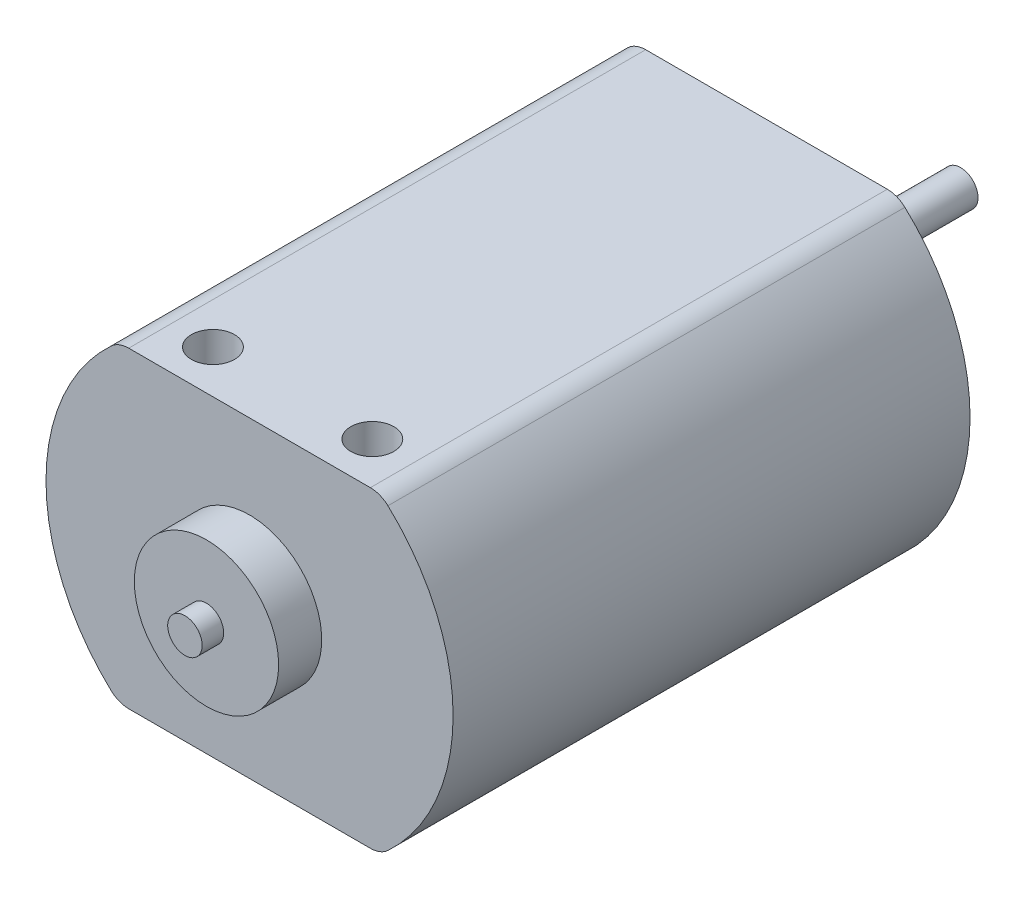
ISO-10303-21;
HEADER;
FILE_DESCRIPTION(('STEP AP214'),'2;1');
FILE_NAME('part.step','',(''),(''),'','','');
FILE_SCHEMA(('AUTOMOTIVE_DESIGN { 1 0 10303 214 1 1 1 1 }'));
ENDSEC;
DATA;
#1=APPLICATION_CONTEXT('core data for automotive mechanical design processes');
#2=APPLICATION_PROTOCOL_DEFINITION('international standard','automotive_design',2000,#1);
#3=PRODUCT_CONTEXT('',#1,'mechanical');
#4=PRODUCT('Part','Part','',(#3));
#5=PRODUCT_RELATED_PRODUCT_CATEGORY('part','',(#4));
#6=PRODUCT_DEFINITION_FORMATION('','',#4);
#7=PRODUCT_DEFINITION_CONTEXT('part definition',#1,'design');
#8=PRODUCT_DEFINITION('design','',#6,#7);
#9=PRODUCT_DEFINITION_SHAPE('','',#8);
#10=(LENGTH_UNIT() NAMED_UNIT(*) SI_UNIT(.MILLI.,.METRE.));
#11=(NAMED_UNIT(*) PLANE_ANGLE_UNIT() SI_UNIT($,.RADIAN.));
#12=(NAMED_UNIT(*) SI_UNIT($,.STERADIAN.) SOLID_ANGLE_UNIT());
#13=UNCERTAINTY_MEASURE_WITH_UNIT(LENGTH_MEASURE(1.E-05),#10,'distance_accuracy_value','');
#14=(GEOMETRIC_REPRESENTATION_CONTEXT(3) GLOBAL_UNCERTAINTY_ASSIGNED_CONTEXT((#13)) GLOBAL_UNIT_ASSIGNED_CONTEXT((#10,
#11,#12)) REPRESENTATION_CONTEXT('',''));
#15=CARTESIAN_POINT('',(0.,0.,0.));
#16=DIRECTION('',(0.,0.,1.));
#17=DIRECTION('',(1.,0.,0.));
#18=AXIS2_PLACEMENT_3D('',#15,#16,#17);
#19=CARTESIAN_POINT('',(0.,0.,-1.5875));
#20=DIRECTION('',(0.,0.,-1.));
#21=DIRECTION('',(-1.,0.,0.));
#22=AXIS2_PLACEMENT_3D('',#19,#20,#21);
#23=PLANE('',#22);
#24=CARTESIAN_POINT('',(0.,0.,-1.5875));
#25=DIRECTION('',(0.,0.,-1.));
#26=DIRECTION('',(-1.,0.,0.));
#27=AXIS2_PLACEMENT_3D('',#24,#25,#26);
#28=CIRCLE('',#27,3.048);
#29=CARTESIAN_POINT('',(-3.048,0.,-1.5875));
#30=VERTEX_POINT('',#29);
#31=EDGE_CURVE('E193',#30,#30,#28,.T.);
#32=ORIENTED_EDGE('',*,*,#31,.T.);
#33=EDGE_LOOP('',(#32));
#34=FACE_BOUND('',#33,.T.);
#35=CARTESIAN_POINT('',(0.,0.,-1.5875));
#36=DIRECTION('',(0.,0.,-1.));
#37=DIRECTION('',(-1.,0.,0.));
#38=AXIS2_PLACEMENT_3D('',#35,#36,#37);
#39=CIRCLE('',#38,1.0287);
#40=CARTESIAN_POINT('',(-1.0287,0.,-1.5875));
#41=VERTEX_POINT('',#40);
#42=EDGE_CURVE('E202',#41,#41,#39,.T.);
#43=ORIENTED_EDGE('',*,*,#42,.F.);
#44=EDGE_LOOP('',(#43));
#45=FACE_BOUND('',#44,.T.);
#46=ADVANCED_FACE('F35',(#34,#45),#23,.T.);
#47=CARTESIAN_POINT('',(-7.12333026048912,-7.6835,0.));
#48=DIRECTION('',(0.,0.,-1.));
#49=DIRECTION('',(-1.,0.,0.));
#50=AXIS2_PLACEMENT_3D('',#47,#48,#49);
#51=PLANE('',#50);
#52=CARTESIAN_POINT('',(-7.12333026048912,-7.6835,0.));
#53=DIRECTION('',(0.,0.,1.));
#54=DIRECTION('',(-1.,0.,0.));
#55=AXIS2_PLACEMENT_3D('',#52,#53,#54);
#56=CIRCLE('',#55,1.524);
#57=CARTESIAN_POINT('',(-8.15945102565117,-8.8011,0.));
#58=VERTEX_POINT('',#57);
#59=CARTESIAN_POINT('',(-7.12333026048912,-9.2075,0.));
#60=VERTEX_POINT('',#59);
#61=EDGE_CURVE('E134',#58,#60,#56,.T.);
#62=ORIENTED_EDGE('',*,*,#61,.F.);
#63=CARTESIAN_POINT('',(0.,0.,0.));
#64=DIRECTION('',(0.,0.,1.));
#65=DIRECTION('',(1.,0.,0.));
#66=AXIS2_PLACEMENT_3D('',#63,#64,#65);
#67=CIRCLE('',#66,12.0015);
#68=CARTESIAN_POINT('',(-8.15945102565117,8.8011,0.));
#69=VERTEX_POINT('',#68);
#70=EDGE_CURVE('E87',#69,#58,#67,.T.);
#71=ORIENTED_EDGE('',*,*,#70,.F.);
#72=CARTESIAN_POINT('',(-7.12333026048912,7.6835,0.));
#73=DIRECTION('',(0.,0.,1.));
#74=DIRECTION('',(1.,0.,0.));
#75=AXIS2_PLACEMENT_3D('',#72,#73,#74);
#76=CIRCLE('',#75,1.524);
#77=CARTESIAN_POINT('',(-7.12333026048912,9.2075,0.));
#78=VERTEX_POINT('',#77);
#79=EDGE_CURVE('E81',#78,#69,#76,.T.);
#80=ORIENTED_EDGE('',*,*,#79,.F.);
#81=DIRECTION('',(-1.,0.,0.));
#82=VECTOR('',#81,1.);
#83=CARTESIAN_POINT('',(-7.12333026048912,9.2075,0.));
#84=LINE('',#83,#82);
#85=CARTESIAN_POINT('',(7.12333026048912,9.2075,0.));
#86=VERTEX_POINT('',#85);
#87=EDGE_CURVE('E124',#86,#78,#84,.T.);
#88=ORIENTED_EDGE('',*,*,#87,.F.);
#89=CARTESIAN_POINT('',(7.12333026048912,7.6835,0.));
#90=DIRECTION('',(0.,0.,1.));
#91=DIRECTION('',(-1.,0.,0.));
#92=AXIS2_PLACEMENT_3D('',#89,#90,#91);
#93=CIRCLE('',#92,1.524);
#94=CARTESIAN_POINT('',(8.15945102565117,8.8011,0.));
#95=VERTEX_POINT('',#94);
#96=EDGE_CURVE('E144',#95,#86,#93,.T.);
#97=ORIENTED_EDGE('',*,*,#96,.F.);
#98=CARTESIAN_POINT('',(0.,0.,0.));
#99=DIRECTION('',(0.,0.,1.));
#100=DIRECTION('',(1.,0.,0.));
#101=AXIS2_PLACEMENT_3D('',#98,#99,#100);
#102=CIRCLE('',#101,12.0015);
#103=CARTESIAN_POINT('',(8.15945102565117,-8.8011,0.));
#104=VERTEX_POINT('',#103);
#105=EDGE_CURVE('E142',#104,#95,#102,.T.);
#106=ORIENTED_EDGE('',*,*,#105,.F.);
#107=CARTESIAN_POINT('',(7.12333026048912,-7.6835,0.));
#108=DIRECTION('',(0.,0.,1.));
#109=DIRECTION('',(1.,0.,0.));
#110=AXIS2_PLACEMENT_3D('',#107,#108,#109);
#111=CIRCLE('',#110,1.524);
#112=CARTESIAN_POINT('',(7.12333026048912,-9.2075,0.));
#113=VERTEX_POINT('',#112);
#114=EDGE_CURVE('E140',#113,#104,#111,.T.);
#115=ORIENTED_EDGE('',*,*,#114,.F.);
#116=DIRECTION('',(1.,0.,0.));
#117=VECTOR('',#116,1.);
#118=CARTESIAN_POINT('',(-7.12333026048912,-9.2075,0.));
#119=LINE('',#118,#117);
#120=EDGE_CURVE('E137',#60,#113,#119,.T.);
#121=ORIENTED_EDGE('',*,*,#120,.F.);
#122=EDGE_LOOP('',(#62,#71,#80,#88,#97,#106,#115,#121));
#123=FACE_BOUND('',#122,.T.);
#124=CARTESIAN_POINT('',(0.,0.,0.));
#125=DIRECTION('',(0.,0.,-1.));
#126=DIRECTION('',(-1.,0.,0.));
#127=AXIS2_PLACEMENT_3D('',#124,#125,#126);
#128=CIRCLE('',#127,3.048);
#129=CARTESIAN_POINT('',(-3.048,0.,0.));
#130=VERTEX_POINT('',#129);
#131=EDGE_CURVE('E196',#130,#130,#128,.T.);
#132=ORIENTED_EDGE('',*,*,#131,.F.);
#133=EDGE_LOOP('',(#132));
#134=FACE_BOUND('',#133,.T.);
#135=ADVANCED_FACE('F167',(#123,#134),#51,.T.);
#136=CARTESIAN_POINT('',(0.,0.,33.02));
#137=DIRECTION('',(0.,0.,1.));
#138=DIRECTION('',(1.,0.,0.));
#139=AXIS2_PLACEMENT_3D('',#136,#137,#138);
#140=PLANE('',#139);
#141=CARTESIAN_POINT('',(0.,0.,33.02));
#142=DIRECTION('',(0.,0.,1.));
#143=DIRECTION('',(1.,0.,0.));
#144=AXIS2_PLACEMENT_3D('',#141,#142,#143);
#145=CIRCLE('',#144,4.2545);
#146=CARTESIAN_POINT('',(4.2545,0.,33.02));
#147=VERTEX_POINT('',#146);
#148=EDGE_CURVE('E138',#147,#147,#145,.T.);
#149=ORIENTED_EDGE('',*,*,#148,.T.);
#150=EDGE_LOOP('',(#149));
#151=FACE_BOUND('',#150,.T.);
#152=CARTESIAN_POINT('',(0.,0.,33.02));
#153=DIRECTION('',(0.,0.,1.));
#154=DIRECTION('',(1.,0.,0.));
#155=AXIS2_PLACEMENT_3D('',#152,#153,#154);
#156=CIRCLE('',#155,1.016);
#157=CARTESIAN_POINT('',(1.016,0.,33.02));
#158=VERTEX_POINT('',#157);
#159=EDGE_CURVE('E190',#158,#158,#156,.T.);
#160=ORIENTED_EDGE('',*,*,#159,.F.);
#161=EDGE_LOOP('',(#160));
#162=FACE_BOUND('',#161,.T.);
#163=ADVANCED_FACE('F256',(#151,#162),#140,.T.);
#164=CARTESIAN_POINT('',(-7.12333026048912,-7.6835,30.48));
#165=DIRECTION('',(0.,0.,-1.));
#166=DIRECTION('',(-1.,0.,0.));
#167=AXIS2_PLACEMENT_3D('',#164,#165,#166);
#168=PLANE('',#167);
#169=CARTESIAN_POINT('',(-7.12333026048912,-7.6835,30.48));
#170=DIRECTION('',(0.,0.,1.));
#171=DIRECTION('',(-1.,0.,0.));
#172=AXIS2_PLACEMENT_3D('',#169,#170,#171);
#173=CIRCLE('',#172,1.524);
#174=CARTESIAN_POINT('',(-8.15945102565117,-8.8011,30.48));
#175=VERTEX_POINT('',#174);
#176=CARTESIAN_POINT('',(-7.12333026048912,-9.2075,30.48));
#177=VERTEX_POINT('',#176);
#178=EDGE_CURVE('E149',#175,#177,#173,.T.);
#179=ORIENTED_EDGE('',*,*,#178,.T.);
#180=DIRECTION('',(1.,0.,0.));
#181=VECTOR('',#180,1.);
#182=CARTESIAN_POINT('',(-7.12333026048912,-9.2075,30.48));
#183=LINE('',#182,#181);
#184=CARTESIAN_POINT('',(7.12333026048912,-9.2075,30.48));
#185=VERTEX_POINT('',#184);
#186=EDGE_CURVE('E96',#177,#185,#183,.T.);
#187=ORIENTED_EDGE('',*,*,#186,.T.);
#188=CARTESIAN_POINT('',(7.12333026048912,-7.6835,30.48));
#189=DIRECTION('',(0.,0.,1.));
#190=DIRECTION('',(1.,0.,0.));
#191=AXIS2_PLACEMENT_3D('',#188,#189,#190);
#192=CIRCLE('',#191,1.524);
#193=CARTESIAN_POINT('',(8.15945102565117,-8.8011,30.48));
#194=VERTEX_POINT('',#193);
#195=EDGE_CURVE('E181',#185,#194,#192,.T.);
#196=ORIENTED_EDGE('',*,*,#195,.T.);
#197=CARTESIAN_POINT('',(0.,0.,30.48));
#198=DIRECTION('',(0.,0.,1.));
#199=DIRECTION('',(1.,0.,0.));
#200=AXIS2_PLACEMENT_3D('',#197,#198,#199);
#201=CIRCLE('',#200,12.0015);
#202=CARTESIAN_POINT('',(8.15945102565117,8.8011,30.48));
#203=VERTEX_POINT('',#202);
#204=EDGE_CURVE('E180',#194,#203,#201,.T.);
#205=ORIENTED_EDGE('',*,*,#204,.T.);
#206=CARTESIAN_POINT('',(7.12333026048912,7.6835,30.48));
#207=DIRECTION('',(0.,0.,1.));
#208=DIRECTION('',(-1.,0.,0.));
#209=AXIS2_PLACEMENT_3D('',#206,#207,#208);
#210=CIRCLE('',#209,1.524);
#211=CARTESIAN_POINT('',(7.12333026048912,9.2075,30.48));
#212=VERTEX_POINT('',#211);
#213=EDGE_CURVE('E116',#203,#212,#210,.T.);
#214=ORIENTED_EDGE('',*,*,#213,.T.);
#215=DIRECTION('',(-1.,0.,0.));
#216=VECTOR('',#215,1.);
#217=CARTESIAN_POINT('',(-7.12333026048912,9.2075,30.48));
#218=LINE('',#217,#216);
#219=CARTESIAN_POINT('',(-7.12333026048912,9.2075,30.48));
#220=VERTEX_POINT('',#219);
#221=EDGE_CURVE('E109',#212,#220,#218,.T.);
#222=ORIENTED_EDGE('',*,*,#221,.T.);
#223=CARTESIAN_POINT('',(-7.12333026048912,7.6835,30.48));
#224=DIRECTION('',(0.,0.,1.));
#225=DIRECTION('',(1.,0.,0.));
#226=AXIS2_PLACEMENT_3D('',#223,#224,#225);
#227=CIRCLE('',#226,1.524);
#228=CARTESIAN_POINT('',(-8.15945102565117,8.8011,30.48));
#229=VERTEX_POINT('',#228);
#230=EDGE_CURVE('E114',#220,#229,#227,.T.);
#231=ORIENTED_EDGE('',*,*,#230,.T.);
#232=CARTESIAN_POINT('',(0.,0.,30.48));
#233=DIRECTION('',(0.,0.,1.));
#234=DIRECTION('',(1.,0.,0.));
#235=AXIS2_PLACEMENT_3D('',#232,#233,#234);
#236=CIRCLE('',#235,12.0015);
#237=EDGE_CURVE('E52',#229,#175,#236,.T.);
#238=ORIENTED_EDGE('',*,*,#237,.T.);
#239=EDGE_LOOP('',(#179,#187,#196,#205,#214,#222,#231,#238));
#240=FACE_BOUND('',#239,.T.);
#241=CARTESIAN_POINT('',(0.,0.,30.48));
#242=DIRECTION('',(0.,0.,-1.));
#243=DIRECTION('',(-1.,0.,0.));
#244=AXIS2_PLACEMENT_3D('',#241,#242,#243);
#245=CIRCLE('',#244,4.2545);
#246=CARTESIAN_POINT('',(-4.2545,0.,30.48));
#247=VERTEX_POINT('',#246);
#248=EDGE_CURVE('E11',#247,#247,#245,.F.);
#249=ORIENTED_EDGE('',*,*,#248,.F.);
#250=EDGE_LOOP('',(#249));
#251=FACE_BOUND('',#250,.T.);
#252=ADVANCED_FACE('F111',(#240,#251),#168,.F.);
#253=CARTESIAN_POINT('',(-7.12333026048912,-7.6835,30.48));
#254=DIRECTION('',(0.,0.,-1.));
#255=DIRECTION('',(-1.,0.,0.));
#256=AXIS2_PLACEMENT_3D('',#253,#254,#255);
#257=CYLINDRICAL_SURFACE('',#256,1.524);
#258=ORIENTED_EDGE('',*,*,#61,.T.);
#259=DIRECTION('',(0.,0.,-1.));
#260=VECTOR('',#259,1.);
#261=CARTESIAN_POINT('',(-7.12333026048912,-9.2075,30.48));
#262=LINE('',#261,#260);
#263=EDGE_CURVE('E44',#177,#60,#262,.T.);
#264=ORIENTED_EDGE('',*,*,#263,.F.);
#265=ORIENTED_EDGE('',*,*,#178,.F.);
#266=DIRECTION('',(0.,0.,-1.));
#267=VECTOR('',#266,1.);
#268=CARTESIAN_POINT('',(-8.15945102565117,-8.8011,30.48));
#269=LINE('',#268,#267);
#270=EDGE_CURVE('E130',#175,#58,#269,.T.);
#271=ORIENTED_EDGE('',*,*,#270,.T.);
#272=EDGE_LOOP('',(#258,#264,#265,#271));
#273=FACE_BOUND('',#272,.T.);
#274=ADVANCED_FACE('F37',(#273),#257,.T.);
#275=CARTESIAN_POINT('',(-7.12333026048912,-9.2075,30.48));
#276=DIRECTION('',(0.,1.,0.));
#277=DIRECTION('',(0.,0.,1.));
#278=AXIS2_PLACEMENT_3D('',#275,#276,#277);
#279=PLANE('',#278);
#280=ORIENTED_EDGE('',*,*,#120,.T.);
#281=DIRECTION('',(0.,0.,-1.));
#282=VECTOR('',#281,1.);
#283=CARTESIAN_POINT('',(7.12333026048912,-9.2075,30.48));
#284=LINE('',#283,#282);
#285=EDGE_CURVE('E159',#185,#113,#284,.T.);
#286=ORIENTED_EDGE('',*,*,#285,.F.);
#287=ORIENTED_EDGE('',*,*,#186,.F.);
#288=ORIENTED_EDGE('',*,*,#263,.T.);
#289=EDGE_LOOP('',(#280,#286,#287,#288));
#290=FACE_BOUND('',#289,.T.);
#291=ADVANCED_FACE('F162',(#290),#279,.F.);
#292=CARTESIAN_POINT('',(7.12333026048912,-7.6835,30.48));
#293=DIRECTION('',(0.,0.,-1.));
#294=DIRECTION('',(-1.,0.,0.));
#295=AXIS2_PLACEMENT_3D('',#292,#293,#294);
#296=CYLINDRICAL_SURFACE('',#295,1.524);
#297=ORIENTED_EDGE('',*,*,#114,.T.);
#298=DIRECTION('',(0.,0.,-1.));
#299=VECTOR('',#298,1.);
#300=CARTESIAN_POINT('',(8.15945102565117,-8.8011,30.48));
#301=LINE('',#300,#299);
#302=EDGE_CURVE('E156',#194,#104,#301,.T.);
#303=ORIENTED_EDGE('',*,*,#302,.F.);
#304=ORIENTED_EDGE('',*,*,#195,.F.);
#305=ORIENTED_EDGE('',*,*,#285,.T.);
#306=EDGE_LOOP('',(#297,#303,#304,#305));
#307=FACE_BOUND('',#306,.T.);
#308=ADVANCED_FACE('F174',(#307),#296,.T.);
#309=CARTESIAN_POINT('',(0.,0.,30.48));
#310=DIRECTION('',(0.,0.,-1.));
#311=DIRECTION('',(-1.,0.,0.));
#312=AXIS2_PLACEMENT_3D('',#309,#310,#311);
#313=CYLINDRICAL_SURFACE('',#312,12.0015);
#314=ORIENTED_EDGE('',*,*,#105,.T.);
#315=DIRECTION('',(0.,0.,-1.));
#316=VECTOR('',#315,1.);
#317=CARTESIAN_POINT('',(8.15945102565117,8.8011,30.48));
#318=LINE('',#317,#316);
#319=EDGE_CURVE('E153',#203,#95,#318,.T.);
#320=ORIENTED_EDGE('',*,*,#319,.F.);
#321=ORIENTED_EDGE('',*,*,#204,.F.);
#322=ORIENTED_EDGE('',*,*,#302,.T.);
#323=EDGE_LOOP('',(#314,#320,#321,#322));
#324=FACE_BOUND('',#323,.T.);
#325=ADVANCED_FACE('F178',(#324),#313,.T.);
#326=CARTESIAN_POINT('',(7.12333026048912,7.6835,30.48));
#327=DIRECTION('',(0.,0.,-1.));
#328=DIRECTION('',(-1.,0.,0.));
#329=AXIS2_PLACEMENT_3D('',#326,#327,#328);
#330=CYLINDRICAL_SURFACE('',#329,1.524);
#331=ORIENTED_EDGE('',*,*,#96,.T.);
#332=DIRECTION('',(0.,0.,-1.));
#333=VECTOR('',#332,1.);
#334=CARTESIAN_POINT('',(7.12333026048912,9.2075,30.48));
#335=LINE('',#334,#333);
#336=EDGE_CURVE('E125',#212,#86,#335,.T.);
#337=ORIENTED_EDGE('',*,*,#336,.F.);
#338=ORIENTED_EDGE('',*,*,#213,.F.);
#339=ORIENTED_EDGE('',*,*,#319,.T.);
#340=EDGE_LOOP('',(#331,#337,#338,#339));
#341=FACE_BOUND('',#340,.T.);
#342=ADVANCED_FACE('F231',(#341),#330,.T.);
#343=CARTESIAN_POINT('',(-7.12333026048912,9.2075,30.48));
#344=DIRECTION('',(0.,-1.,0.));
#345=DIRECTION('',(1.,0.,0.));
#346=AXIS2_PLACEMENT_3D('',#343,#344,#345);
#347=PLANE('',#346);
#348=CARTESIAN_POINT('',(-4.699,9.2075,27.94));
#349=DIRECTION('',(0.,1.,0.));
#350=DIRECTION('',(0.,0.,1.));
#351=AXIS2_PLACEMENT_3D('',#348,#349,#350);
#352=CIRCLE('',#351,1.27);
#353=CARTESIAN_POINT('',(-4.699,9.2075,29.21));
#354=VERTEX_POINT('',#353);
#355=EDGE_CURVE('E214',#354,#354,#352,.T.);
#356=ORIENTED_EDGE('',*,*,#355,.F.);
#357=EDGE_LOOP('',(#356));
#358=FACE_BOUND('',#357,.T.);
#359=CARTESIAN_POINT('',(4.699,9.2075,27.94));
#360=DIRECTION('',(0.,1.,0.));
#361=DIRECTION('',(0.,0.,1.));
#362=AXIS2_PLACEMENT_3D('',#359,#360,#361);
#363=CIRCLE('',#362,1.27);
#364=CARTESIAN_POINT('',(4.699,9.2075,29.21));
#365=VERTEX_POINT('',#364);
#366=EDGE_CURVE('E208',#365,#365,#363,.T.);
#367=ORIENTED_EDGE('',*,*,#366,.F.);
#368=EDGE_LOOP('',(#367));
#369=FACE_BOUND('',#368,.T.);
#370=ORIENTED_EDGE('',*,*,#87,.T.);
#371=DIRECTION('',(0.,0.,-1.));
#372=VECTOR('',#371,1.);
#373=CARTESIAN_POINT('',(-7.12333026048912,9.2075,30.48));
#374=LINE('',#373,#372);
#375=EDGE_CURVE('E121',#220,#78,#374,.T.);
#376=ORIENTED_EDGE('',*,*,#375,.F.);
#377=ORIENTED_EDGE('',*,*,#221,.F.);
#378=ORIENTED_EDGE('',*,*,#336,.T.);
#379=EDGE_LOOP('',(#370,#376,#377,#378));
#380=FACE_BOUND('',#379,.T.);
#381=ADVANCED_FACE('F122',(#358,#369,#380),#347,.F.);
#382=CARTESIAN_POINT('',(-7.12333026048912,7.6835,30.48));
#383=DIRECTION('',(0.,0.,-1.));
#384=DIRECTION('',(-1.,0.,0.));
#385=AXIS2_PLACEMENT_3D('',#382,#383,#384);
#386=CYLINDRICAL_SURFACE('',#385,1.524);
#387=ORIENTED_EDGE('',*,*,#79,.T.);
#388=DIRECTION('',(0.,0.,-1.));
#389=VECTOR('',#388,1.);
#390=CARTESIAN_POINT('',(-8.15945102565117,8.8011,30.48));
#391=LINE('',#390,#389);
#392=EDGE_CURVE('E126',#229,#69,#391,.T.);
#393=ORIENTED_EDGE('',*,*,#392,.F.);
#394=ORIENTED_EDGE('',*,*,#230,.F.);
#395=ORIENTED_EDGE('',*,*,#375,.T.);
#396=EDGE_LOOP('',(#387,#393,#394,#395));
#397=FACE_BOUND('',#396,.T.);
#398=ADVANCED_FACE('F128',(#397),#386,.T.);
#399=CARTESIAN_POINT('',(0.,0.,30.48));
#400=DIRECTION('',(0.,0.,-1.));
#401=DIRECTION('',(-1.,0.,0.));
#402=AXIS2_PLACEMENT_3D('',#399,#400,#401);
#403=CYLINDRICAL_SURFACE('',#402,12.0015);
#404=ORIENTED_EDGE('',*,*,#70,.T.);
#405=ORIENTED_EDGE('',*,*,#270,.F.);
#406=ORIENTED_EDGE('',*,*,#237,.F.);
#407=ORIENTED_EDGE('',*,*,#392,.T.);
#408=EDGE_LOOP('',(#404,#405,#406,#407));
#409=FACE_BOUND('',#408,.T.);
#410=ADVANCED_FACE('F279',(#409),#403,.T.);
#411=CARTESIAN_POINT('',(0.,0.,33.02));
#412=DIRECTION('',(0.,0.,-1.));
#413=DIRECTION('',(-1.,0.,0.));
#414=AXIS2_PLACEMENT_3D('',#411,#412,#413);
#415=CYLINDRICAL_SURFACE('',#414,4.2545);
#416=ORIENTED_EDGE('',*,*,#148,.F.);
#417=EDGE_LOOP('',(#416));
#418=FACE_BOUND('',#417,.T.);
#419=ORIENTED_EDGE('',*,*,#248,.T.);
#420=EDGE_LOOP('',(#419));
#421=FACE_BOUND('',#420,.T.);
#422=ADVANCED_FACE('F272',(#418,#421),#415,.T.);
#423=CARTESIAN_POINT('',(0.,0.,34.29));
#424=DIRECTION('',(0.,0.,-1.));
#425=DIRECTION('',(-1.,0.,0.));
#426=AXIS2_PLACEMENT_3D('',#423,#424,#425);
#427=CYLINDRICAL_SURFACE('',#426,1.016);
#428=CARTESIAN_POINT('',(0.,0.,34.29));
#429=DIRECTION('',(0.,0.,1.));
#430=DIRECTION('',(1.,0.,0.));
#431=AXIS2_PLACEMENT_3D('',#428,#429,#430);
#432=CIRCLE('',#431,1.016);
#433=CARTESIAN_POINT('',(1.016,0.,34.29));
#434=VERTEX_POINT('',#433);
#435=EDGE_CURVE('E189',#434,#434,#432,.T.);
#436=ORIENTED_EDGE('',*,*,#435,.F.);
#437=EDGE_LOOP('',(#436));
#438=FACE_BOUND('',#437,.T.);
#439=ORIENTED_EDGE('',*,*,#159,.T.);
#440=EDGE_LOOP('',(#439));
#441=FACE_BOUND('',#440,.T.);
#442=ADVANCED_FACE('F268',(#438,#441),#427,.T.);
#443=CARTESIAN_POINT('',(0.,0.,34.29));
#444=DIRECTION('',(0.,0.,1.));
#445=DIRECTION('',(1.,0.,0.));
#446=AXIS2_PLACEMENT_3D('',#443,#444,#445);
#447=PLANE('',#446);
#448=ORIENTED_EDGE('',*,*,#435,.T.);
#449=EDGE_LOOP('',(#448));
#450=FACE_BOUND('',#449,.T.);
#451=ADVANCED_FACE('F264',(#450),#447,.T.);
#452=CARTESIAN_POINT('',(0.,0.,-1.5875));
#453=DIRECTION('',(0.,0.,1.));
#454=DIRECTION('',(1.,0.,0.));
#455=AXIS2_PLACEMENT_3D('',#452,#453,#454);
#456=CYLINDRICAL_SURFACE('',#455,3.048);
#457=ORIENTED_EDGE('',*,*,#31,.F.);
#458=EDGE_LOOP('',(#457));
#459=FACE_BOUND('',#458,.T.);
#460=ORIENTED_EDGE('',*,*,#131,.T.);
#461=EDGE_LOOP('',(#460));
#462=FACE_BOUND('',#461,.T.);
#463=ADVANCED_FACE('F261',(#459,#462),#456,.T.);
#464=CARTESIAN_POINT('',(0.,0.,-11.4427));
#465=DIRECTION('',(0.,0.,1.));
#466=DIRECTION('',(1.,0.,0.));
#467=AXIS2_PLACEMENT_3D('',#464,#465,#466);
#468=CYLINDRICAL_SURFACE('',#467,1.0287);
#469=CARTESIAN_POINT('',(0.,0.,-11.4427));
#470=DIRECTION('',(0.,0.,-1.));
#471=DIRECTION('',(-1.,0.,0.));
#472=AXIS2_PLACEMENT_3D('',#469,#470,#471);
#473=CIRCLE('',#472,1.0287);
#474=CARTESIAN_POINT('',(-1.0287,0.,-11.4427));
#475=VERTEX_POINT('',#474);
#476=EDGE_CURVE('E199',#475,#475,#473,.T.);
#477=ORIENTED_EDGE('',*,*,#476,.F.);
#478=EDGE_LOOP('',(#477));
#479=FACE_BOUND('',#478,.T.);
#480=ORIENTED_EDGE('',*,*,#42,.T.);
#481=EDGE_LOOP('',(#480));
#482=FACE_BOUND('',#481,.T.);
#483=ADVANCED_FACE('F246',(#479,#482),#468,.T.);
#484=CARTESIAN_POINT('',(0.,0.,-11.4427));
#485=DIRECTION('',(0.,0.,-1.));
#486=DIRECTION('',(-1.,0.,0.));
#487=AXIS2_PLACEMENT_3D('',#484,#485,#486);
#488=PLANE('',#487);
#489=ORIENTED_EDGE('',*,*,#476,.T.);
#490=EDGE_LOOP('',(#489));
#491=FACE_BOUND('',#490,.T.);
#492=ADVANCED_FACE('F237',(#491),#488,.T.);
#493=CARTESIAN_POINT('',(4.699,6.0325,27.94));
#494=DIRECTION('',(0.,1.,0.));
#495=DIRECTION('',(0.,0.,1.));
#496=AXIS2_PLACEMENT_3D('',#493,#494,#495);
#497=CYLINDRICAL_SURFACE('',#496,1.27);
#498=CARTESIAN_POINT('',(4.699,6.0325,27.94));
#499=DIRECTION('',(0.,1.,0.));
#500=DIRECTION('',(0.,0.,1.));
#501=AXIS2_PLACEMENT_3D('',#498,#499,#500);
#502=CIRCLE('',#501,1.27);
#503=CARTESIAN_POINT('',(4.699,6.0325,29.21));
#504=VERTEX_POINT('',#503);
#505=EDGE_CURVE('E205',#504,#504,#502,.T.);
#506=ORIENTED_EDGE('',*,*,#505,.F.);
#507=EDGE_LOOP('',(#506));
#508=FACE_BOUND('',#507,.T.);
#509=ORIENTED_EDGE('',*,*,#366,.T.);
#510=EDGE_LOOP('',(#509));
#511=FACE_BOUND('',#510,.T.);
#512=ADVANCED_FACE('F235',(#508,#511),#497,.F.);
#513=CARTESIAN_POINT('',(4.699,6.0325,27.94));
#514=DIRECTION('',(0.,1.,0.));
#515=DIRECTION('',(0.,0.,1.));
#516=AXIS2_PLACEMENT_3D('',#513,#514,#515);
#517=PLANE('',#516);
#518=ORIENTED_EDGE('',*,*,#505,.T.);
#519=EDGE_LOOP('',(#518));
#520=FACE_BOUND('',#519,.T.);
#521=ADVANCED_FACE('F225',(#520),#517,.T.);
#522=CARTESIAN_POINT('',(-4.699,6.0325,27.94));
#523=DIRECTION('',(0.,1.,0.));
#524=DIRECTION('',(0.,0.,1.));
#525=AXIS2_PLACEMENT_3D('',#522,#523,#524);
#526=CYLINDRICAL_SURFACE('',#525,1.27);
#527=CARTESIAN_POINT('',(-4.699,6.0325,27.94));
#528=DIRECTION('',(0.,1.,0.));
#529=DIRECTION('',(0.,0.,1.));
#530=AXIS2_PLACEMENT_3D('',#527,#528,#529);
#531=CIRCLE('',#530,1.27);
#532=CARTESIAN_POINT('',(-4.699,6.0325,29.21));
#533=VERTEX_POINT('',#532);
#534=EDGE_CURVE('E211',#533,#533,#531,.T.);
#535=ORIENTED_EDGE('',*,*,#534,.F.);
#536=EDGE_LOOP('',(#535));
#537=FACE_BOUND('',#536,.T.);
#538=ORIENTED_EDGE('',*,*,#355,.T.);
#539=EDGE_LOOP('',(#538));
#540=FACE_BOUND('',#539,.T.);
#541=ADVANCED_FACE('F222',(#537,#540),#526,.F.);
#542=CARTESIAN_POINT('',(-4.699,6.0325,27.94));
#543=DIRECTION('',(0.,1.,0.));
#544=DIRECTION('',(0.,0.,1.));
#545=AXIS2_PLACEMENT_3D('',#542,#543,#544);
#546=PLANE('',#545);
#547=ORIENTED_EDGE('',*,*,#534,.T.);
#548=EDGE_LOOP('',(#547));
#549=FACE_BOUND('',#548,.T.);
#550=ADVANCED_FACE('F220',(#549),#546,.T.);
#551=CLOSED_SHELL('',(#46,#135,#163,#252,#274,#291,#308,#325,#342,#381,#398,#410,#422,#442,#451,
#463,#483,#492,#512,#521,#541,#550));
#552=MANIFOLD_SOLID_BREP('B2',#551);
#553=ADVANCED_BREP_SHAPE_REPRESENTATION('',(#18,#552),#14);
#554=SHAPE_DEFINITION_REPRESENTATION(#9,#553);
ENDSEC;
END-ISO-10303-21;
